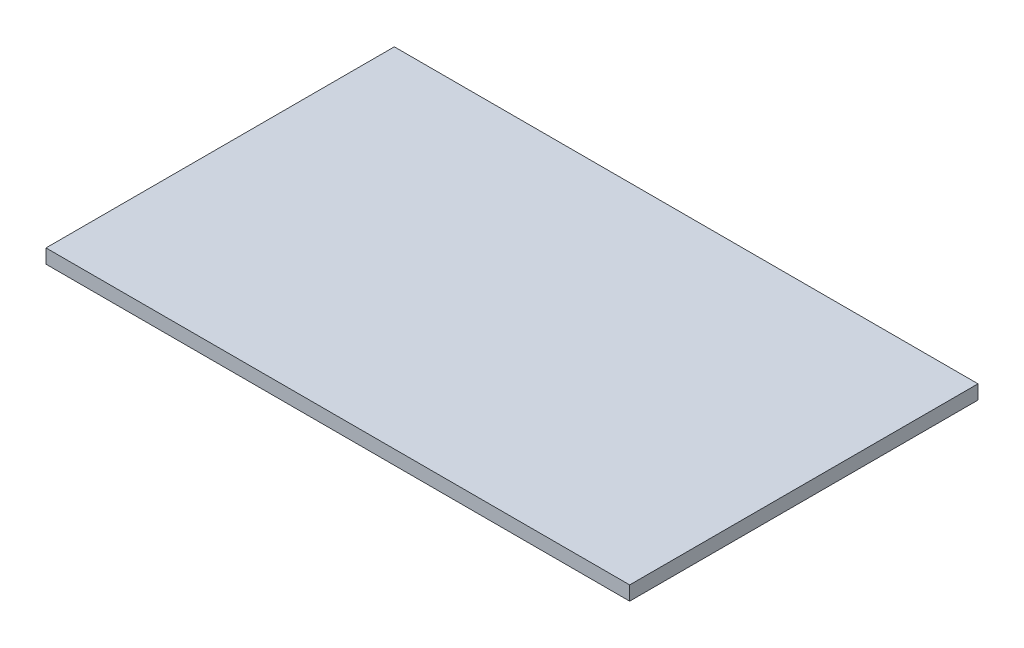
ISO-10303-21;
HEADER;
FILE_DESCRIPTION(('STEP AP214'),'2;1');
FILE_NAME('part.step','',(''),(''),'','','');
FILE_SCHEMA(('AUTOMOTIVE_DESIGN { 1 0 10303 214 1 1 1 1 }'));
ENDSEC;
DATA;
#1=APPLICATION_CONTEXT('core data for automotive mechanical design processes');
#2=APPLICATION_PROTOCOL_DEFINITION('international standard','automotive_design',2000,#1);
#3=PRODUCT_CONTEXT('',#1,'mechanical');
#4=PRODUCT('Part','Part','',(#3));
#5=PRODUCT_RELATED_PRODUCT_CATEGORY('part','',(#4));
#6=PRODUCT_DEFINITION_FORMATION('','',#4);
#7=PRODUCT_DEFINITION_CONTEXT('part definition',#1,'design');
#8=PRODUCT_DEFINITION('design','',#6,#7);
#9=PRODUCT_DEFINITION_SHAPE('','',#8);
#10=(LENGTH_UNIT() NAMED_UNIT(*) SI_UNIT(.MILLI.,.METRE.));
#11=(NAMED_UNIT(*) PLANE_ANGLE_UNIT() SI_UNIT($,.RADIAN.));
#12=(NAMED_UNIT(*) SI_UNIT($,.STERADIAN.) SOLID_ANGLE_UNIT());
#13=UNCERTAINTY_MEASURE_WITH_UNIT(LENGTH_MEASURE(1.E-05),#10,'distance_accuracy_value','');
#14=(GEOMETRIC_REPRESENTATION_CONTEXT(3) GLOBAL_UNCERTAINTY_ASSIGNED_CONTEXT((#13)) GLOBAL_UNIT_ASSIGNED_CONTEXT((#10,
#11,#12)) REPRESENTATION_CONTEXT('',''));
#15=CARTESIAN_POINT('',(0.,0.,0.));
#16=DIRECTION('',(0.,0.,1.));
#17=DIRECTION('',(1.,0.,0.));
#18=AXIS2_PLACEMENT_3D('',#15,#16,#17);
#19=CARTESIAN_POINT('',(0.,1.5,0.));
#20=DIRECTION('',(1.,0.,0.));
#21=DIRECTION('',(0.,0.,-1.));
#22=AXIS2_PLACEMENT_3D('',#19,#20,#21);
#23=PLANE('',#22);
#24=DIRECTION('',(0.,0.,1.));
#25=VECTOR('',#24,1.);
#26=CARTESIAN_POINT('',(0.,0.,0.));
#27=LINE('',#26,#25);
#28=CARTESIAN_POINT('',(0.,0.,-37.));
#29=VERTEX_POINT('',#28);
#30=CARTESIAN_POINT('',(0.,0.,0.));
#31=VERTEX_POINT('',#30);
#32=EDGE_CURVE('E96',#29,#31,#27,.T.);
#33=ORIENTED_EDGE('',*,*,#32,.T.);
#34=DIRECTION('',(0.,-1.,0.));
#35=VECTOR('',#34,1.);
#36=CARTESIAN_POINT('',(0.,1.5,0.));
#37=LINE('',#36,#35);
#38=CARTESIAN_POINT('',(0.,1.5,0.));
#39=VERTEX_POINT('',#38);
#40=EDGE_CURVE('E11',#39,#31,#37,.T.);
#41=ORIENTED_EDGE('',*,*,#40,.F.);
#42=DIRECTION('',(0.,0.,1.));
#43=VECTOR('',#42,1.);
#44=CARTESIAN_POINT('',(0.,1.5,0.));
#45=LINE('',#44,#43);
#46=CARTESIAN_POINT('',(0.,1.5,-37.));
#47=VERTEX_POINT('',#46);
#48=EDGE_CURVE('E84',#47,#39,#45,.T.);
#49=ORIENTED_EDGE('',*,*,#48,.F.);
#50=DIRECTION('',(0.,-1.,0.));
#51=VECTOR('',#50,1.);
#52=CARTESIAN_POINT('',(0.,1.5,-37.));
#53=LINE('',#52,#51);
#54=EDGE_CURVE('E92',#47,#29,#53,.T.);
#55=ORIENTED_EDGE('',*,*,#54,.T.);
#56=EDGE_LOOP('',(#33,#41,#49,#55));
#57=FACE_BOUND('',#56,.T.);
#58=ADVANCED_FACE('F33',(#57),#23,.F.);
#59=CARTESIAN_POINT('',(0.,1.5,0.));
#60=DIRECTION('',(0.,0.,-1.));
#61=DIRECTION('',(-1.,0.,0.));
#62=AXIS2_PLACEMENT_3D('',#59,#60,#61);
#63=PLANE('',#62);
#64=DIRECTION('',(1.,0.,0.));
#65=VECTOR('',#64,1.);
#66=CARTESIAN_POINT('',(0.,0.,0.));
#67=LINE('',#66,#65);
#68=CARTESIAN_POINT('',(62.,0.,0.));
#69=VERTEX_POINT('',#68);
#70=EDGE_CURVE('E88',#31,#69,#67,.T.);
#71=ORIENTED_EDGE('',*,*,#70,.T.);
#72=DIRECTION('',(0.,-1.,0.));
#73=VECTOR('',#72,1.);
#74=CARTESIAN_POINT('',(62.,1.5,0.));
#75=LINE('',#74,#73);
#76=CARTESIAN_POINT('',(62.,1.5,0.));
#77=VERTEX_POINT('',#76);
#78=EDGE_CURVE('E41',#77,#69,#75,.T.);
#79=ORIENTED_EDGE('',*,*,#78,.F.);
#80=DIRECTION('',(1.,0.,0.));
#81=VECTOR('',#80,1.);
#82=CARTESIAN_POINT('',(0.,1.5,0.));
#83=LINE('',#82,#81);
#84=EDGE_CURVE('E79',#39,#77,#83,.T.);
#85=ORIENTED_EDGE('',*,*,#84,.F.);
#86=ORIENTED_EDGE('',*,*,#40,.T.);
#87=EDGE_LOOP('',(#71,#79,#85,#86));
#88=FACE_BOUND('',#87,.T.);
#89=ADVANCED_FACE('F87',(#88),#63,.F.);
#90=CARTESIAN_POINT('',(62.,1.5,0.));
#91=DIRECTION('',(-1.,0.,0.));
#92=DIRECTION('',(0.,0.,1.));
#93=AXIS2_PLACEMENT_3D('',#90,#91,#92);
#94=PLANE('',#93);
#95=DIRECTION('',(0.,0.,-1.));
#96=VECTOR('',#95,1.);
#97=CARTESIAN_POINT('',(62.,0.,0.));
#98=LINE('',#97,#96);
#99=CARTESIAN_POINT('',(62.,0.,-37.));
#100=VERTEX_POINT('',#99);
#101=EDGE_CURVE('E66',#69,#100,#98,.T.);
#102=ORIENTED_EDGE('',*,*,#101,.T.);
#103=DIRECTION('',(0.,-1.,0.));
#104=VECTOR('',#103,1.);
#105=CARTESIAN_POINT('',(62.,1.5,-37.));
#106=LINE('',#105,#104);
#107=CARTESIAN_POINT('',(62.,1.5,-37.));
#108=VERTEX_POINT('',#107);
#109=EDGE_CURVE('E89',#108,#100,#106,.T.);
#110=ORIENTED_EDGE('',*,*,#109,.F.);
#111=DIRECTION('',(0.,0.,-1.));
#112=VECTOR('',#111,1.);
#113=CARTESIAN_POINT('',(62.,1.5,0.));
#114=LINE('',#113,#112);
#115=EDGE_CURVE('E82',#77,#108,#114,.T.);
#116=ORIENTED_EDGE('',*,*,#115,.F.);
#117=ORIENTED_EDGE('',*,*,#78,.T.);
#118=EDGE_LOOP('',(#102,#110,#116,#117));
#119=FACE_BOUND('',#118,.T.);
#120=ADVANCED_FACE('F90',(#119),#94,.F.);
#121=CARTESIAN_POINT('',(0.,1.5,-37.));
#122=DIRECTION('',(0.,0.,1.));
#123=DIRECTION('',(1.,0.,0.));
#124=AXIS2_PLACEMENT_3D('',#121,#122,#123);
#125=PLANE('',#124);
#126=DIRECTION('',(-1.,0.,0.));
#127=VECTOR('',#126,1.);
#128=CARTESIAN_POINT('',(0.,0.,-37.));
#129=LINE('',#128,#127);
#130=EDGE_CURVE('E72',#100,#29,#129,.T.);
#131=ORIENTED_EDGE('',*,*,#130,.T.);
#132=ORIENTED_EDGE('',*,*,#54,.F.);
#133=DIRECTION('',(-1.,0.,0.));
#134=VECTOR('',#133,1.);
#135=CARTESIAN_POINT('',(0.,1.5,-37.));
#136=LINE('',#135,#134);
#137=EDGE_CURVE('E49',#108,#47,#136,.T.);
#138=ORIENTED_EDGE('',*,*,#137,.F.);
#139=ORIENTED_EDGE('',*,*,#109,.T.);
#140=EDGE_LOOP('',(#131,#132,#138,#139));
#141=FACE_BOUND('',#140,.T.);
#142=ADVANCED_FACE('F103',(#141),#125,.F.);
#143=CARTESIAN_POINT('',(0.,1.5,0.));
#144=DIRECTION('',(0.,-1.,0.));
#145=DIRECTION('',(0.,0.,-1.));
#146=AXIS2_PLACEMENT_3D('',#143,#144,#145);
#147=PLANE('',#146);
#148=ORIENTED_EDGE('',*,*,#48,.T.);
#149=ORIENTED_EDGE('',*,*,#84,.T.);
#150=ORIENTED_EDGE('',*,*,#115,.T.);
#151=ORIENTED_EDGE('',*,*,#137,.T.);
#152=EDGE_LOOP('',(#148,#149,#150,#151));
#153=FACE_BOUND('',#152,.T.);
#154=ADVANCED_FACE('F80',(#153),#147,.F.);
#155=CARTESIAN_POINT('',(0.,0.,0.));
#156=DIRECTION('',(0.,-1.,0.));
#157=DIRECTION('',(0.,0.,-1.));
#158=AXIS2_PLACEMENT_3D('',#155,#156,#157);
#159=PLANE('',#158);
#160=ORIENTED_EDGE('',*,*,#32,.F.);
#161=ORIENTED_EDGE('',*,*,#130,.F.);
#162=ORIENTED_EDGE('',*,*,#101,.F.);
#163=ORIENTED_EDGE('',*,*,#70,.F.);
#164=EDGE_LOOP('',(#160,#161,#162,#163));
#165=FACE_BOUND('',#164,.T.);
#166=ADVANCED_FACE('F106',(#165),#159,.T.);
#167=CLOSED_SHELL('',(#58,#89,#120,#142,#154,#166));
#168=MANIFOLD_SOLID_BREP('B2',#167);
#169=ADVANCED_BREP_SHAPE_REPRESENTATION('',(#18,#168),#14);
#170=SHAPE_DEFINITION_REPRESENTATION(#9,#169);
ENDSEC;
END-ISO-10303-21;
